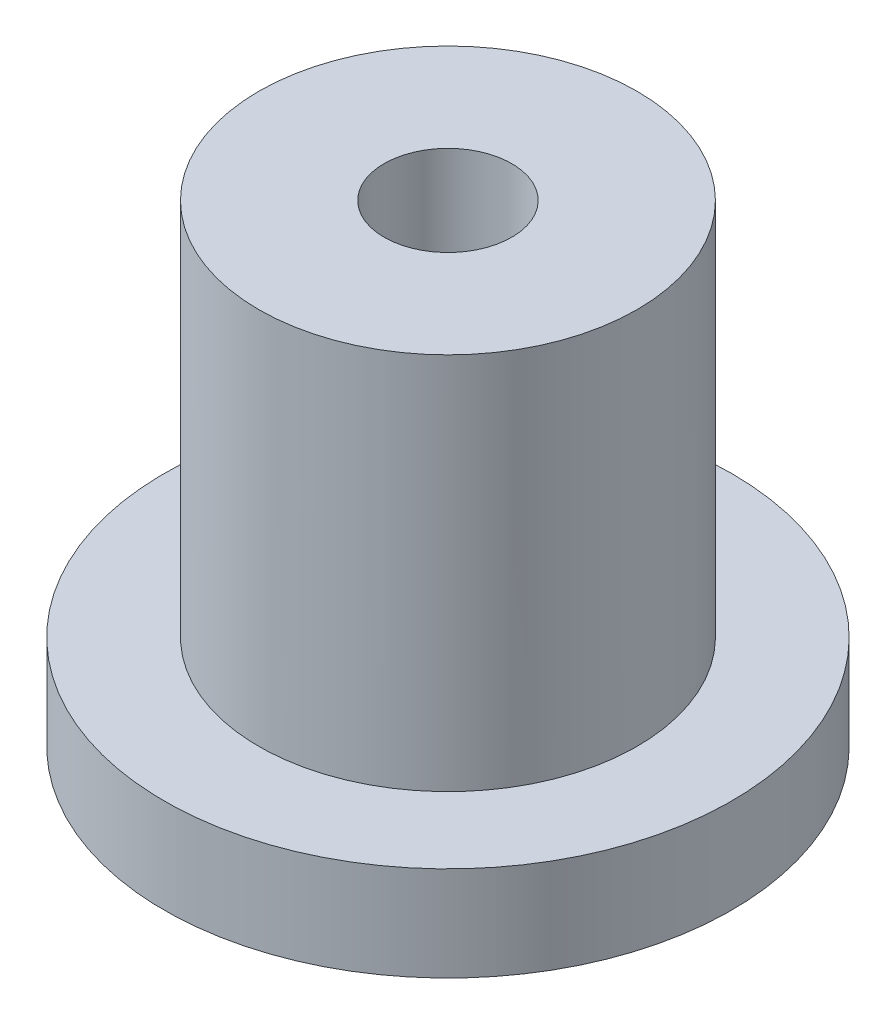
ISO-10303-21;
HEADER;
FILE_DESCRIPTION(('STEP AP214'),'2;1');
FILE_NAME('part.step','',(''),(''),'','','');
FILE_SCHEMA(('AUTOMOTIVE_DESIGN { 1 0 10303 214 1 1 1 1 }'));
ENDSEC;
DATA;
#1=APPLICATION_CONTEXT('core data for automotive mechanical design processes');
#2=APPLICATION_PROTOCOL_DEFINITION('international standard','automotive_design',2000,#1);
#3=PRODUCT_CONTEXT('',#1,'mechanical');
#4=PRODUCT('Part','Part','',(#3));
#5=PRODUCT_RELATED_PRODUCT_CATEGORY('part','',(#4));
#6=PRODUCT_DEFINITION_FORMATION('','',#4);
#7=PRODUCT_DEFINITION_CONTEXT('part definition',#1,'design');
#8=PRODUCT_DEFINITION('design','',#6,#7);
#9=PRODUCT_DEFINITION_SHAPE('','',#8);
#10=(LENGTH_UNIT() NAMED_UNIT(*) SI_UNIT(.MILLI.,.METRE.));
#11=(NAMED_UNIT(*) PLANE_ANGLE_UNIT() SI_UNIT($,.RADIAN.));
#12=(NAMED_UNIT(*) SI_UNIT($,.STERADIAN.) SOLID_ANGLE_UNIT());
#13=UNCERTAINTY_MEASURE_WITH_UNIT(LENGTH_MEASURE(1.E-05),#10,'distance_accuracy_value','');
#14=(GEOMETRIC_REPRESENTATION_CONTEXT(3) GLOBAL_UNCERTAINTY_ASSIGNED_CONTEXT((#13)) GLOBAL_UNIT_ASSIGNED_CONTEXT((#10,
#11,#12)) REPRESENTATION_CONTEXT('',''));
#15=CARTESIAN_POINT('',(0.,0.,0.));
#16=DIRECTION('',(0.,0.,1.));
#17=DIRECTION('',(1.,0.,0.));
#18=AXIS2_PLACEMENT_3D('',#15,#16,#17);
#19=CARTESIAN_POINT('',(0.,8.,0.));
#20=DIRECTION('',(0.,-1.,0.));
#21=DIRECTION('',(0.,0.,-1.));
#22=AXIS2_PLACEMENT_3D('',#19,#20,#21);
#23=CYLINDRICAL_SURFACE('',#22,4.);
#24=CARTESIAN_POINT('',(0.,8.,0.));
#25=DIRECTION('',(0.,1.,0.));
#26=DIRECTION('',(0.,0.,1.));
#27=AXIS2_PLACEMENT_3D('',#24,#25,#26);
#28=CIRCLE('',#27,4.);
#29=CARTESIAN_POINT('',(0.,8.,4.));
#30=VERTEX_POINT('',#29);
#31=EDGE_CURVE('E10',#30,#30,#28,.T.);
#32=ORIENTED_EDGE('',*,*,#31,.F.);
#33=EDGE_LOOP('',(#32));
#34=FACE_BOUND('',#33,.T.);
#35=CARTESIAN_POINT('',(0.,0.,0.));
#36=DIRECTION('',(0.,-1.,0.));
#37=DIRECTION('',(0.,0.,-1.));
#38=AXIS2_PLACEMENT_3D('',#35,#36,#37);
#39=CIRCLE('',#38,4.);
#40=CARTESIAN_POINT('',(0.,0.,-4.));
#41=VERTEX_POINT('',#40);
#42=EDGE_CURVE('E38',#41,#41,#39,.T.);
#43=ORIENTED_EDGE('',*,*,#42,.F.);
#44=EDGE_LOOP('',(#43));
#45=FACE_BOUND('',#44,.T.);
#46=ADVANCED_FACE('F31',(#34,#45),#23,.T.);
#47=CARTESIAN_POINT('',(0.,8.,0.));
#48=DIRECTION('',(0.,1.,0.));
#49=DIRECTION('',(0.,0.,1.));
#50=AXIS2_PLACEMENT_3D('',#47,#48,#49);
#51=PLANE('',#50);
#52=CARTESIAN_POINT('',(0.,8.,0.));
#53=DIRECTION('',(0.,1.,0.));
#54=DIRECTION('',(0.,0.,1.));
#55=AXIS2_PLACEMENT_3D('',#52,#53,#54);
#56=CIRCLE('',#55,1.35);
#57=CARTESIAN_POINT('',(0.,8.,1.35));
#58=VERTEX_POINT('',#57);
#59=EDGE_CURVE('E50',#58,#58,#56,.T.);
#60=ORIENTED_EDGE('',*,*,#59,.F.);
#61=EDGE_LOOP('',(#60));
#62=FACE_BOUND('',#61,.T.);
#63=ORIENTED_EDGE('',*,*,#31,.T.);
#64=EDGE_LOOP('',(#63));
#65=FACE_BOUND('',#64,.T.);
#66=ADVANCED_FACE('F69',(#62,#65),#51,.T.);
#67=CARTESIAN_POINT('',(0.,-2.,0.));
#68=DIRECTION('',(0.,1.,0.));
#69=DIRECTION('',(0.,0.,1.));
#70=AXIS2_PLACEMENT_3D('',#67,#68,#69);
#71=CYLINDRICAL_SURFACE('',#70,6.);
#72=CARTESIAN_POINT('',(0.,-2.,0.));
#73=DIRECTION('',(0.,-1.,0.));
#74=DIRECTION('',(0.,0.,-1.));
#75=AXIS2_PLACEMENT_3D('',#72,#73,#74);
#76=CIRCLE('',#75,6.);
#77=CARTESIAN_POINT('',(0.,-2.,-6.));
#78=VERTEX_POINT('',#77);
#79=EDGE_CURVE('E42',#78,#78,#76,.T.);
#80=ORIENTED_EDGE('',*,*,#79,.F.);
#81=EDGE_LOOP('',(#80));
#82=FACE_BOUND('',#81,.T.);
#83=CARTESIAN_POINT('',(0.,0.,0.));
#84=DIRECTION('',(0.,-1.,0.));
#85=DIRECTION('',(0.,0.,-1.));
#86=AXIS2_PLACEMENT_3D('',#83,#84,#85);
#87=CIRCLE('',#86,6.);
#88=CARTESIAN_POINT('',(0.,0.,-6.));
#89=VERTEX_POINT('',#88);
#90=EDGE_CURVE('E45',#89,#89,#87,.T.);
#91=ORIENTED_EDGE('',*,*,#90,.T.);
#92=EDGE_LOOP('',(#91));
#93=FACE_BOUND('',#92,.T.);
#94=ADVANCED_FACE('F63',(#82,#93),#71,.T.);
#95=CARTESIAN_POINT('',(0.,-2.,0.));
#96=DIRECTION('',(0.,-1.,0.));
#97=DIRECTION('',(0.,0.,-1.));
#98=AXIS2_PLACEMENT_3D('',#95,#96,#97);
#99=PLANE('',#98);
#100=CARTESIAN_POINT('',(0.,-2.,0.));
#101=DIRECTION('',(0.,-1.,0.));
#102=DIRECTION('',(0.,0.,-1.));
#103=AXIS2_PLACEMENT_3D('',#100,#101,#102);
#104=CIRCLE('',#103,1.35);
#105=CARTESIAN_POINT('',(0.,-2.,-1.35));
#106=VERTEX_POINT('',#105);
#107=EDGE_CURVE('E34',#106,#106,#104,.T.);
#108=ORIENTED_EDGE('',*,*,#107,.F.);
#109=EDGE_LOOP('',(#108));
#110=FACE_BOUND('',#109,.T.);
#111=ORIENTED_EDGE('',*,*,#79,.T.);
#112=EDGE_LOOP('',(#111));
#113=FACE_BOUND('',#112,.T.);
#114=ADVANCED_FACE('F59',(#110,#113),#99,.T.);
#115=CARTESIAN_POINT('',(0.,0.,0.));
#116=DIRECTION('',(0.,-1.,0.));
#117=DIRECTION('',(0.,0.,-1.));
#118=AXIS2_PLACEMENT_3D('',#115,#116,#117);
#119=PLANE('',#118);
#120=ORIENTED_EDGE('',*,*,#42,.T.);
#121=EDGE_LOOP('',(#120));
#122=FACE_BOUND('',#121,.T.);
#123=ORIENTED_EDGE('',*,*,#90,.F.);
#124=EDGE_LOOP('',(#123));
#125=FACE_BOUND('',#124,.T.);
#126=ADVANCED_FACE('F62',(#122,#125),#119,.F.);
#127=CARTESIAN_POINT('',(0.,-4.,0.));
#128=DIRECTION('',(0.,1.,0.));
#129=DIRECTION('',(0.,0.,1.));
#130=AXIS2_PLACEMENT_3D('',#127,#128,#129);
#131=CYLINDRICAL_SURFACE('',#130,1.35);
#132=ORIENTED_EDGE('',*,*,#107,.T.);
#133=EDGE_LOOP('',(#132));
#134=FACE_BOUND('',#133,.T.);
#135=ORIENTED_EDGE('',*,*,#59,.T.);
#136=EDGE_LOOP('',(#135));
#137=FACE_BOUND('',#136,.T.);
#138=ADVANCED_FACE('F57',(#134,#137),#131,.F.);
#139=CLOSED_SHELL('',(#46,#66,#94,#114,#126,#138));
#140=MANIFOLD_SOLID_BREP('B2',#139);
#141=ADVANCED_BREP_SHAPE_REPRESENTATION('',(#18,#140),#14);
#142=SHAPE_DEFINITION_REPRESENTATION(#9,#141);
ENDSEC;
END-ISO-10303-21;
